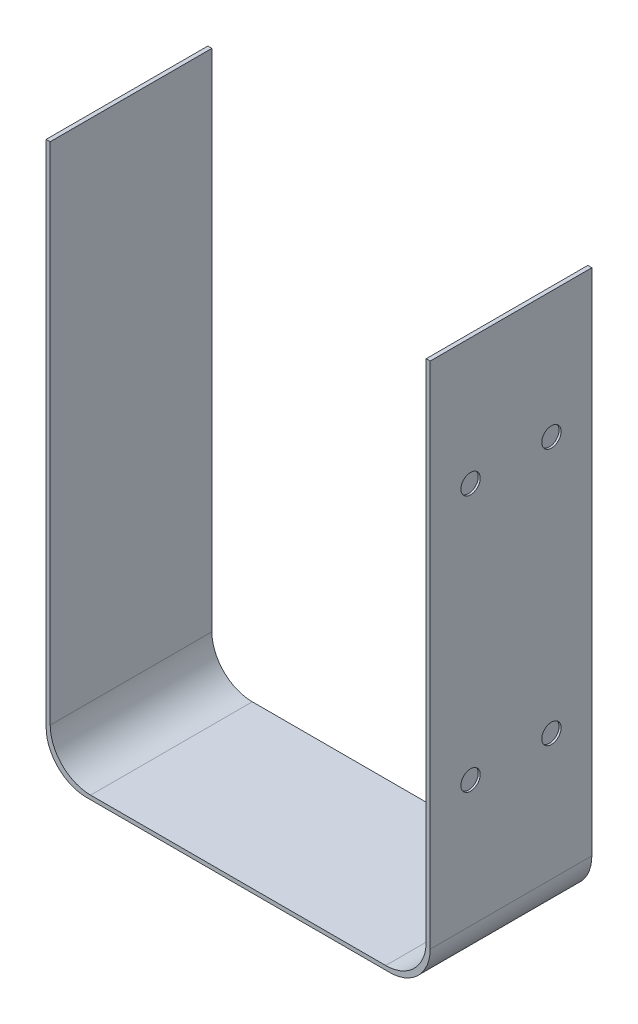
ISO-10303-21;
HEADER;
FILE_DESCRIPTION(('STEP AP214'),'2;1');
FILE_NAME('part.step','',(''),(''),'','','');
FILE_SCHEMA(('AUTOMOTIVE_DESIGN { 1 0 10303 214 1 1 1 1 }'));
ENDSEC;
DATA;
#1=APPLICATION_CONTEXT('core data for automotive mechanical design processes');
#2=APPLICATION_PROTOCOL_DEFINITION('international standard','automotive_design',2000,#1);
#3=PRODUCT_CONTEXT('',#1,'mechanical');
#4=PRODUCT('Part','Part','',(#3));
#5=PRODUCT_RELATED_PRODUCT_CATEGORY('part','',(#4));
#6=PRODUCT_DEFINITION_FORMATION('','',#4);
#7=PRODUCT_DEFINITION_CONTEXT('part definition',#1,'design');
#8=PRODUCT_DEFINITION('design','',#6,#7);
#9=PRODUCT_DEFINITION_SHAPE('','',#8);
#10=(LENGTH_UNIT() NAMED_UNIT(*) SI_UNIT(.MILLI.,.METRE.));
#11=(NAMED_UNIT(*) PLANE_ANGLE_UNIT() SI_UNIT($,.RADIAN.));
#12=(NAMED_UNIT(*) SI_UNIT($,.STERADIAN.) SOLID_ANGLE_UNIT());
#13=UNCERTAINTY_MEASURE_WITH_UNIT(LENGTH_MEASURE(1.E-05),#10,'distance_accuracy_value','');
#14=(GEOMETRIC_REPRESENTATION_CONTEXT(3) GLOBAL_UNCERTAINTY_ASSIGNED_CONTEXT((#13)) GLOBAL_UNIT_ASSIGNED_CONTEXT((#10,
#11,#12)) REPRESENTATION_CONTEXT('',''));
#15=CARTESIAN_POINT('',(0.,0.,0.));
#16=DIRECTION('',(0.,0.,1.));
#17=DIRECTION('',(1.,0.,0.));
#18=AXIS2_PLACEMENT_3D('',#15,#16,#17);
#19=CARTESIAN_POINT('',(-54.6515602948094,-3.22142857142857,8.));
#20=DIRECTION('',(0.,0.,-1.));
#21=DIRECTION('',(-1.,0.,0.));
#22=AXIS2_PLACEMENT_3D('',#19,#20,#21);
#23=CYLINDRICAL_SURFACE('',#22,2.);
#24=CARTESIAN_POINT('',(-54.6515602948094,-3.22142857142857,0.));
#25=DIRECTION('',(0.,0.,-1.));
#26=DIRECTION('',(1.,0.,0.));
#27=AXIS2_PLACEMENT_3D('',#24,#25,#26);
#28=CIRCLE('',#27,2.);
#29=CARTESIAN_POINT('',(-54.6515602948094,-5.22142857142857,0.));
#30=VERTEX_POINT('',#29);
#31=CARTESIAN_POINT('',(-56.6515602948094,-3.22142857142855,0.));
#32=VERTEX_POINT('',#31);
#33=EDGE_CURVE('E153',#30,#32,#28,.T.);
#34=ORIENTED_EDGE('',*,*,#33,.T.);
#35=DIRECTION('',(0.,0.,-1.));
#36=VECTOR('',#35,1.);
#37=CARTESIAN_POINT('',(-56.6515602948094,-3.22142857142855,8.));
#38=LINE('',#37,#36);
#39=CARTESIAN_POINT('',(-56.6515602948094,-3.22142857142855,8.));
#40=VERTEX_POINT('',#39);
#41=EDGE_CURVE('E11',#40,#32,#38,.T.);
#42=ORIENTED_EDGE('',*,*,#41,.F.);
#43=CARTESIAN_POINT('',(-54.6515602948094,-3.22142857142857,8.));
#44=DIRECTION('',(0.,0.,-1.));
#45=DIRECTION('',(1.,0.,0.));
#46=AXIS2_PLACEMENT_3D('',#43,#44,#45);
#47=CIRCLE('',#46,2.);
#48=CARTESIAN_POINT('',(-54.6515602948094,-5.22142857142857,8.));
#49=VERTEX_POINT('',#48);
#50=EDGE_CURVE('E176',#49,#40,#47,.T.);
#51=ORIENTED_EDGE('',*,*,#50,.F.);
#52=DIRECTION('',(0.,0.,-1.));
#53=VECTOR('',#52,1.);
#54=CARTESIAN_POINT('',(-54.6515602948094,-5.22142857142857,8.));
#55=LINE('',#54,#53);
#56=EDGE_CURVE('E149',#49,#30,#55,.T.);
#57=ORIENTED_EDGE('',*,*,#56,.T.);
#58=EDGE_LOOP('',(#34,#42,#51,#57));
#59=FACE_BOUND('',#58,.T.);
#60=ADVANCED_FACE('F33',(#59),#23,.F.);
#61=CARTESIAN_POINT('',(-56.6515602948094,21.7785714285714,8.));
#62=DIRECTION('',(-1.,0.,0.));
#63=DIRECTION('',(0.,0.,1.));
#64=AXIS2_PLACEMENT_3D('',#61,#62,#63);
#65=PLANE('',#64);
#66=DIRECTION('',(0.,1.,0.));
#67=VECTOR('',#66,1.);
#68=CARTESIAN_POINT('',(-56.6515602948094,21.7785714285714,0.));
#69=LINE('',#68,#67);
#70=CARTESIAN_POINT('',(-56.6515602948094,21.7785714285714,0.));
#71=VERTEX_POINT('',#70);
#72=EDGE_CURVE('E156',#32,#71,#69,.T.);
#73=ORIENTED_EDGE('',*,*,#72,.T.);
#74=DIRECTION('',(0.,0.,-1.));
#75=VECTOR('',#74,1.);
#76=CARTESIAN_POINT('',(-56.6515602948094,21.7785714285714,8.));
#77=LINE('',#76,#75);
#78=CARTESIAN_POINT('',(-56.6515602948094,21.7785714285714,8.));
#79=VERTEX_POINT('',#78);
#80=EDGE_CURVE('E41',#79,#71,#77,.T.);
#81=ORIENTED_EDGE('',*,*,#80,.F.);
#82=DIRECTION('',(0.,1.,0.));
#83=VECTOR('',#82,1.);
#84=CARTESIAN_POINT('',(-56.6515602948094,21.7785714285714,8.));
#85=LINE('',#84,#83);
#86=EDGE_CURVE('E104',#40,#79,#85,.T.);
#87=ORIENTED_EDGE('',*,*,#86,.F.);
#88=ORIENTED_EDGE('',*,*,#41,.T.);
#89=EDGE_LOOP('',(#73,#81,#87,#88));
#90=FACE_BOUND('',#89,.T.);
#91=ADVANCED_FACE('F254',(#90),#65,.F.);
#92=CARTESIAN_POINT('',(-56.6515602948094,21.7785714285714,8.));
#93=DIRECTION('',(0.,-1.,0.));
#94=DIRECTION('',(0.,0.,-1.));
#95=AXIS2_PLACEMENT_3D('',#92,#93,#94);
#96=PLANE('',#95);
#97=DIRECTION('',(-1.,0.,0.));
#98=VECTOR('',#97,1.);
#99=CARTESIAN_POINT('',(-56.6515602948094,21.7785714285714,0.));
#100=LINE('',#99,#98);
#101=CARTESIAN_POINT('',(-56.8515602948094,21.7785714285714,0.));
#102=VERTEX_POINT('',#101);
#103=EDGE_CURVE('E159',#71,#102,#100,.T.);
#104=ORIENTED_EDGE('',*,*,#103,.T.);
#105=DIRECTION('',(0.,0.,-1.));
#106=VECTOR('',#105,1.);
#107=CARTESIAN_POINT('',(-56.8515602948094,21.7785714285714,8.));
#108=LINE('',#107,#106);
#109=CARTESIAN_POINT('',(-56.8515602948094,21.7785714285714,8.));
#110=VERTEX_POINT('',#109);
#111=EDGE_CURVE('E195',#110,#102,#108,.T.);
#112=ORIENTED_EDGE('',*,*,#111,.F.);
#113=DIRECTION('',(-1.,0.,0.));
#114=VECTOR('',#113,1.);
#115=CARTESIAN_POINT('',(-56.6515602948094,21.7785714285714,8.));
#116=LINE('',#115,#114);
#117=EDGE_CURVE('E203',#79,#110,#116,.T.);
#118=ORIENTED_EDGE('',*,*,#117,.F.);
#119=ORIENTED_EDGE('',*,*,#80,.T.);
#120=EDGE_LOOP('',(#104,#112,#118,#119));
#121=FACE_BOUND('',#120,.T.);
#122=ADVANCED_FACE('F201',(#121),#96,.F.);
#123=CARTESIAN_POINT('',(-56.8515602948094,21.7785714285714,8.));
#124=DIRECTION('',(1.,0.,0.));
#125=DIRECTION('',(0.,0.,-1.));
#126=AXIS2_PLACEMENT_3D('',#123,#124,#125);
#127=PLANE('',#126);
#128=CARTESIAN_POINT('',(-56.8515602948094,15.5285714285714,2.));
#129=DIRECTION('',(-1.,0.,0.));
#130=DIRECTION('',(0.,0.,-1.));
#131=AXIS2_PLACEMENT_3D('',#128,#129,#130);
#132=CIRCLE('',#131,0.499999999999999);
#133=CARTESIAN_POINT('',(-56.8515602948094,15.5285714285714,1.5));
#134=VERTEX_POINT('',#133);
#135=EDGE_CURVE('E491',#134,#134,#132,.T.);
#136=ORIENTED_EDGE('',*,*,#135,.F.);
#137=EDGE_LOOP('',(#136));
#138=FACE_BOUND('',#137,.T.);
#139=CARTESIAN_POINT('',(-56.8515602948094,15.5285714285714,6.));
#140=DIRECTION('',(-1.,0.,0.));
#141=DIRECTION('',(0.,0.,1.));
#142=AXIS2_PLACEMENT_3D('',#139,#140,#141);
#143=CIRCLE('',#142,0.499999999999999);
#144=CARTESIAN_POINT('',(-56.8515602948094,15.5285714285714,6.5));
#145=VERTEX_POINT('',#144);
#146=EDGE_CURVE('E490',#145,#145,#143,.T.);
#147=ORIENTED_EDGE('',*,*,#146,.F.);
#148=EDGE_LOOP('',(#147));
#149=FACE_BOUND('',#148,.T.);
#150=CARTESIAN_POINT('',(-56.8515602948094,2.82857142857145,6.));
#151=DIRECTION('',(-1.,0.,0.));
#152=DIRECTION('',(0.,0.,-1.));
#153=AXIS2_PLACEMENT_3D('',#150,#151,#152);
#154=CIRCLE('',#153,0.499999999999999);
#155=CARTESIAN_POINT('',(-56.8515602948094,2.82857142857145,5.5));
#156=VERTEX_POINT('',#155);
#157=EDGE_CURVE('E549',#156,#156,#154,.T.);
#158=ORIENTED_EDGE('',*,*,#157,.F.);
#159=EDGE_LOOP('',(#158));
#160=FACE_BOUND('',#159,.T.);
#161=CARTESIAN_POINT('',(-56.8515602948094,2.82857142857144,2.));
#162=DIRECTION('',(-1.,0.,0.));
#163=DIRECTION('',(0.,0.,1.));
#164=AXIS2_PLACEMENT_3D('',#161,#162,#163);
#165=CIRCLE('',#164,0.499999999999999);
#166=CARTESIAN_POINT('',(-56.8515602948094,2.82857142857144,2.5));
#167=VERTEX_POINT('',#166);
#168=EDGE_CURVE('E504',#167,#167,#165,.T.);
#169=ORIENTED_EDGE('',*,*,#168,.F.);
#170=EDGE_LOOP('',(#169));
#171=FACE_BOUND('',#170,.T.);
#172=DIRECTION('',(0.,-1.,0.));
#173=VECTOR('',#172,1.);
#174=CARTESIAN_POINT('',(-56.8515602948094,21.7785714285714,0.));
#175=LINE('',#174,#173);
#176=CARTESIAN_POINT('',(-56.8515602948094,-3.42142857142855,0.));
#177=VERTEX_POINT('',#176);
#178=EDGE_CURVE('E161',#102,#177,#175,.T.);
#179=ORIENTED_EDGE('',*,*,#178,.T.);
#180=DIRECTION('',(0.,0.,-1.));
#181=VECTOR('',#180,1.);
#182=CARTESIAN_POINT('',(-56.8515602948094,-3.42142857142855,8.));
#183=LINE('',#182,#181);
#184=CARTESIAN_POINT('',(-56.8515602948094,-3.42142857142855,8.));
#185=VERTEX_POINT('',#184);
#186=EDGE_CURVE('E192',#185,#177,#183,.T.);
#187=ORIENTED_EDGE('',*,*,#186,.F.);
#188=DIRECTION('',(0.,-1.,0.));
#189=VECTOR('',#188,1.);
#190=CARTESIAN_POINT('',(-56.8515602948094,21.7785714285714,8.));
#191=LINE('',#190,#189);
#192=EDGE_CURVE('E221',#110,#185,#191,.T.);
#193=ORIENTED_EDGE('',*,*,#192,.F.);
#194=ORIENTED_EDGE('',*,*,#111,.T.);
#195=EDGE_LOOP('',(#179,#187,#193,#194));
#196=FACE_BOUND('',#195,.T.);
#197=ADVANCED_FACE('F212',(#138,#149,#160,#171,#196),#127,.F.);
#198=CARTESIAN_POINT('',(-54.8515602948094,-3.42142857142857,8.));
#199=DIRECTION('',(0.,0.,-1.));
#200=DIRECTION('',(-1.,0.,0.));
#201=AXIS2_PLACEMENT_3D('',#198,#199,#200);
#202=CYLINDRICAL_SURFACE('',#201,2.);
#203=CARTESIAN_POINT('',(-54.8515602948094,-3.42142857142857,0.));
#204=DIRECTION('',(0.,0.,1.));
#205=DIRECTION('',(1.,0.,0.));
#206=AXIS2_PLACEMENT_3D('',#203,#204,#205);
#207=CIRCLE('',#206,2.);
#208=CARTESIAN_POINT('',(-54.8515602948094,-5.42142857142857,0.));
#209=VERTEX_POINT('',#208);
#210=EDGE_CURVE('E163',#177,#209,#207,.T.);
#211=ORIENTED_EDGE('',*,*,#210,.T.);
#212=DIRECTION('',(0.,0.,-1.));
#213=VECTOR('',#212,1.);
#214=CARTESIAN_POINT('',(-54.8515602948094,-5.42142857142857,8.));
#215=LINE('',#214,#213);
#216=CARTESIAN_POINT('',(-54.8515602948094,-5.42142857142857,8.));
#217=VERTEX_POINT('',#216);
#218=EDGE_CURVE('E189',#217,#209,#215,.T.);
#219=ORIENTED_EDGE('',*,*,#218,.F.);
#220=CARTESIAN_POINT('',(-54.8515602948094,-3.42142857142857,8.));
#221=DIRECTION('',(0.,0.,1.));
#222=DIRECTION('',(1.,0.,0.));
#223=AXIS2_PLACEMENT_3D('',#220,#221,#222);
#224=CIRCLE('',#223,2.);
#225=EDGE_CURVE('E218',#185,#217,#224,.T.);
#226=ORIENTED_EDGE('',*,*,#225,.F.);
#227=ORIENTED_EDGE('',*,*,#186,.T.);
#228=EDGE_LOOP('',(#211,#219,#226,#227));
#229=FACE_BOUND('',#228,.T.);
#230=ADVANCED_FACE('F216',(#229),#202,.T.);
#231=CARTESIAN_POINT('',(-54.8515602948094,-5.42142857142857,8.));
#232=DIRECTION('',(0.,1.,0.));
#233=DIRECTION('',(-1.,0.,0.));
#234=AXIS2_PLACEMENT_3D('',#231,#232,#233);
#235=PLANE('',#234);
#236=DIRECTION('',(1.,0.,0.));
#237=VECTOR('',#236,1.);
#238=CARTESIAN_POINT('',(-54.8515602948094,-5.42142857142857,0.));
#239=LINE('',#238,#237);
#240=CARTESIAN_POINT('',(-39.8515602948095,-5.42142857142857,0.));
#241=VERTEX_POINT('',#240);
#242=EDGE_CURVE('E165',#209,#241,#239,.T.);
#243=ORIENTED_EDGE('',*,*,#242,.T.);
#244=DIRECTION('',(0.,0.,-1.));
#245=VECTOR('',#244,1.);
#246=CARTESIAN_POINT('',(-39.8515602948095,-5.42142857142857,8.));
#247=LINE('',#246,#245);
#248=CARTESIAN_POINT('',(-39.8515602948095,-5.42142857142857,8.));
#249=VERTEX_POINT('',#248);
#250=EDGE_CURVE('E186',#249,#241,#247,.T.);
#251=ORIENTED_EDGE('',*,*,#250,.F.);
#252=DIRECTION('',(1.,0.,0.));
#253=VECTOR('',#252,1.);
#254=CARTESIAN_POINT('',(-54.8515602948094,-5.42142857142857,8.));
#255=LINE('',#254,#253);
#256=EDGE_CURVE('E220',#217,#249,#255,.T.);
#257=ORIENTED_EDGE('',*,*,#256,.F.);
#258=ORIENTED_EDGE('',*,*,#218,.T.);
#259=EDGE_LOOP('',(#243,#251,#257,#258));
#260=FACE_BOUND('',#259,.T.);
#261=ADVANCED_FACE('F268',(#260),#235,.F.);
#262=CARTESIAN_POINT('',(-39.8515602948094,-3.42142857142857,8.));
#263=DIRECTION('',(0.,0.,-1.));
#264=DIRECTION('',(-1.,0.,0.));
#265=AXIS2_PLACEMENT_3D('',#262,#263,#264);
#266=CYLINDRICAL_SURFACE('',#265,2.);
#267=CARTESIAN_POINT('',(-39.8515602948094,-3.42142857142857,0.));
#268=DIRECTION('',(0.,0.,1.));
#269=DIRECTION('',(-1.,0.,0.));
#270=AXIS2_PLACEMENT_3D('',#267,#268,#269);
#271=CIRCLE('',#270,2.);
#272=CARTESIAN_POINT('',(-37.8515602948094,-3.42142857142856,0.));
#273=VERTEX_POINT('',#272);
#274=EDGE_CURVE('E167',#241,#273,#271,.T.);
#275=ORIENTED_EDGE('',*,*,#274,.T.);
#276=DIRECTION('',(0.,0.,-1.));
#277=VECTOR('',#276,1.);
#278=CARTESIAN_POINT('',(-37.8515602948094,-3.42142857142856,8.));
#279=LINE('',#278,#277);
#280=CARTESIAN_POINT('',(-37.8515602948094,-3.42142857142856,8.));
#281=VERTEX_POINT('',#280);
#282=EDGE_CURVE('E183',#281,#273,#279,.T.);
#283=ORIENTED_EDGE('',*,*,#282,.F.);
#284=CARTESIAN_POINT('',(-39.8515602948094,-3.42142857142857,8.));
#285=DIRECTION('',(0.,0.,1.));
#286=DIRECTION('',(-1.,0.,0.));
#287=AXIS2_PLACEMENT_3D('',#284,#285,#286);
#288=CIRCLE('',#287,2.);
#289=EDGE_CURVE('E223',#249,#281,#288,.T.);
#290=ORIENTED_EDGE('',*,*,#289,.F.);
#291=ORIENTED_EDGE('',*,*,#250,.T.);
#292=EDGE_LOOP('',(#275,#283,#290,#291));
#293=FACE_BOUND('',#292,.T.);
#294=ADVANCED_FACE('F271',(#293),#266,.T.);
#295=CARTESIAN_POINT('',(-37.8515602948094,21.7785714285714,8.));
#296=DIRECTION('',(-1.,0.,0.));
#297=DIRECTION('',(0.,0.,1.));
#298=AXIS2_PLACEMENT_3D('',#295,#296,#297);
#299=PLANE('',#298);
#300=CARTESIAN_POINT('',(-37.8515602948094,2.82857142857144,6.));
#301=DIRECTION('',(1.,0.,0.));
#302=DIRECTION('',(0.,0.,1.));
#303=AXIS2_PLACEMENT_3D('',#300,#301,#302);
#304=CIRCLE('',#303,0.478785513283905);
#305=CARTESIAN_POINT('',(-37.8515602948094,2.82857142857144,6.4787855132839));
#306=VERTEX_POINT('',#305);
#307=EDGE_CURVE('E503',#306,#306,#304,.T.);
#308=ORIENTED_EDGE('',*,*,#307,.F.);
#309=EDGE_LOOP('',(#308));
#310=FACE_BOUND('',#309,.T.);
#311=CARTESIAN_POINT('',(-37.8515602948094,2.82857142857144,2.));
#312=DIRECTION('',(1.,0.,0.));
#313=DIRECTION('',(0.,0.,-1.));
#314=AXIS2_PLACEMENT_3D('',#311,#312,#313);
#315=CIRCLE('',#314,0.478785513283905);
#316=CARTESIAN_POINT('',(-37.8515602948094,2.82857142857144,1.5212144867161));
#317=VERTEX_POINT('',#316);
#318=EDGE_CURVE('E518',#317,#317,#315,.T.);
#319=ORIENTED_EDGE('',*,*,#318,.F.);
#320=EDGE_LOOP('',(#319));
#321=FACE_BOUND('',#320,.T.);
#322=CARTESIAN_POINT('',(-37.8515602948094,15.5285714285714,2.));
#323=DIRECTION('',(1.,0.,0.));
#324=DIRECTION('',(0.,0.,1.));
#325=AXIS2_PLACEMENT_3D('',#322,#323,#324);
#326=CIRCLE('',#325,0.478785513283905);
#327=CARTESIAN_POINT('',(-37.8515602948094,15.5285714285714,2.47878551328391));
#328=VERTEX_POINT('',#327);
#329=EDGE_CURVE('E512',#328,#328,#326,.T.);
#330=ORIENTED_EDGE('',*,*,#329,.F.);
#331=EDGE_LOOP('',(#330));
#332=FACE_BOUND('',#331,.T.);
#333=CARTESIAN_POINT('',(-37.8515602948094,15.5285714285714,6.));
#334=DIRECTION('',(1.,0.,0.));
#335=DIRECTION('',(0.,0.,-1.));
#336=AXIS2_PLACEMENT_3D('',#333,#334,#335);
#337=CIRCLE('',#336,0.478785513283905);
#338=CARTESIAN_POINT('',(-37.8515602948094,15.5285714285714,5.5212144867161));
#339=VERTEX_POINT('',#338);
#340=EDGE_CURVE('E511',#339,#339,#337,.T.);
#341=ORIENTED_EDGE('',*,*,#340,.F.);
#342=EDGE_LOOP('',(#341));
#343=FACE_BOUND('',#342,.T.);
#344=DIRECTION('',(0.,1.,0.));
#345=VECTOR('',#344,1.);
#346=CARTESIAN_POINT('',(-37.8515602948094,21.7785714285714,0.));
#347=LINE('',#346,#345);
#348=CARTESIAN_POINT('',(-37.8515602948094,21.7785714285714,0.));
#349=VERTEX_POINT('',#348);
#350=EDGE_CURVE('E169',#273,#349,#347,.T.);
#351=ORIENTED_EDGE('',*,*,#350,.T.);
#352=DIRECTION('',(0.,0.,-1.));
#353=VECTOR('',#352,1.);
#354=CARTESIAN_POINT('',(-37.8515602948094,21.7785714285714,8.));
#355=LINE('',#354,#353);
#356=CARTESIAN_POINT('',(-37.8515602948094,21.7785714285714,8.));
#357=VERTEX_POINT('',#356);
#358=EDGE_CURVE('E180',#357,#349,#355,.T.);
#359=ORIENTED_EDGE('',*,*,#358,.F.);
#360=DIRECTION('',(0.,1.,0.));
#361=VECTOR('',#360,1.);
#362=CARTESIAN_POINT('',(-37.8515602948094,21.7785714285714,8.));
#363=LINE('',#362,#361);
#364=EDGE_CURVE('E229',#281,#357,#363,.T.);
#365=ORIENTED_EDGE('',*,*,#364,.F.);
#366=ORIENTED_EDGE('',*,*,#282,.T.);
#367=EDGE_LOOP('',(#351,#359,#365,#366));
#368=FACE_BOUND('',#367,.T.);
#369=ADVANCED_FACE('F235',(#310,#321,#332,#343,#368),#299,.F.);
#370=CARTESIAN_POINT('',(-37.8515602948094,21.7785714285714,8.));
#371=DIRECTION('',(0.,-1.,0.));
#372=DIRECTION('',(0.,0.,-1.));
#373=AXIS2_PLACEMENT_3D('',#370,#371,#372);
#374=PLANE('',#373);
#375=DIRECTION('',(-1.,0.,0.));
#376=VECTOR('',#375,1.);
#377=CARTESIAN_POINT('',(-37.8515602948094,21.7785714285714,0.));
#378=LINE('',#377,#376);
#379=CARTESIAN_POINT('',(-38.0515602948094,21.7785714285714,0.));
#380=VERTEX_POINT('',#379);
#381=EDGE_CURVE('E171',#349,#380,#378,.T.);
#382=ORIENTED_EDGE('',*,*,#381,.T.);
#383=DIRECTION('',(0.,0.,-1.));
#384=VECTOR('',#383,1.);
#385=CARTESIAN_POINT('',(-38.0515602948094,21.7785714285714,8.));
#386=LINE('',#385,#384);
#387=CARTESIAN_POINT('',(-38.0515602948094,21.7785714285714,8.));
#388=VERTEX_POINT('',#387);
#389=EDGE_CURVE('E144',#388,#380,#386,.T.);
#390=ORIENTED_EDGE('',*,*,#389,.F.);
#391=DIRECTION('',(-1.,0.,0.));
#392=VECTOR('',#391,1.);
#393=CARTESIAN_POINT('',(-37.8515602948094,21.7785714285714,8.));
#394=LINE('',#393,#392);
#395=EDGE_CURVE('E135',#357,#388,#394,.T.);
#396=ORIENTED_EDGE('',*,*,#395,.F.);
#397=ORIENTED_EDGE('',*,*,#358,.T.);
#398=EDGE_LOOP('',(#382,#390,#396,#397));
#399=FACE_BOUND('',#398,.T.);
#400=ADVANCED_FACE('F239',(#399),#374,.F.);
#401=CARTESIAN_POINT('',(-38.0515602948094,21.7785714285714,8.));
#402=DIRECTION('',(1.,0.,0.));
#403=DIRECTION('',(0.,0.,-1.));
#404=AXIS2_PLACEMENT_3D('',#401,#402,#403);
#405=PLANE('',#404);
#406=DIRECTION('',(0.,-1.,0.));
#407=VECTOR('',#406,1.);
#408=CARTESIAN_POINT('',(-38.0515602948094,21.7785714285714,0.));
#409=LINE('',#408,#407);
#410=CARTESIAN_POINT('',(-38.0515602948094,-3.22142857142855,0.));
#411=VERTEX_POINT('',#410);
#412=EDGE_CURVE('E143',#380,#411,#409,.T.);
#413=ORIENTED_EDGE('',*,*,#412,.T.);
#414=DIRECTION('',(0.,0.,-1.));
#415=VECTOR('',#414,1.);
#416=CARTESIAN_POINT('',(-38.0515602948094,-3.22142857142855,8.));
#417=LINE('',#416,#415);
#418=CARTESIAN_POINT('',(-38.0515602948094,-3.22142857142855,8.));
#419=VERTEX_POINT('',#418);
#420=EDGE_CURVE('E140',#419,#411,#417,.T.);
#421=ORIENTED_EDGE('',*,*,#420,.F.);
#422=DIRECTION('',(0.,-1.,0.));
#423=VECTOR('',#422,1.);
#424=CARTESIAN_POINT('',(-38.0515602948094,21.7785714285714,8.));
#425=LINE('',#424,#423);
#426=EDGE_CURVE('E129',#388,#419,#425,.T.);
#427=ORIENTED_EDGE('',*,*,#426,.F.);
#428=ORIENTED_EDGE('',*,*,#389,.T.);
#429=EDGE_LOOP('',(#413,#421,#427,#428));
#430=FACE_BOUND('',#429,.T.);
#431=ADVANCED_FACE('F141',(#430),#405,.F.);
#432=CARTESIAN_POINT('',(-40.0515602948094,-3.22142857142857,8.));
#433=DIRECTION('',(0.,0.,-1.));
#434=DIRECTION('',(-1.,0.,0.));
#435=AXIS2_PLACEMENT_3D('',#432,#433,#434);
#436=CYLINDRICAL_SURFACE('',#435,2.);
#437=CARTESIAN_POINT('',(-40.0515602948094,-3.22142857142857,0.));
#438=DIRECTION('',(0.,0.,-1.));
#439=DIRECTION('',(-1.,0.,0.));
#440=AXIS2_PLACEMENT_3D('',#437,#438,#439);
#441=CIRCLE('',#440,2.);
#442=CARTESIAN_POINT('',(-40.0515602948095,-5.22142857142857,0.));
#443=VERTEX_POINT('',#442);
#444=EDGE_CURVE('E90',#411,#443,#441,.T.);
#445=ORIENTED_EDGE('',*,*,#444,.T.);
#446=DIRECTION('',(0.,0.,-1.));
#447=VECTOR('',#446,1.);
#448=CARTESIAN_POINT('',(-40.0515602948095,-5.22142857142857,8.));
#449=LINE('',#448,#447);
#450=CARTESIAN_POINT('',(-40.0515602948095,-5.22142857142857,8.));
#451=VERTEX_POINT('',#450);
#452=EDGE_CURVE('E145',#451,#443,#449,.T.);
#453=ORIENTED_EDGE('',*,*,#452,.F.);
#454=CARTESIAN_POINT('',(-40.0515602948094,-3.22142857142857,8.));
#455=DIRECTION('',(0.,0.,-1.));
#456=DIRECTION('',(-1.,0.,0.));
#457=AXIS2_PLACEMENT_3D('',#454,#455,#456);
#458=CIRCLE('',#457,2.);
#459=EDGE_CURVE('E133',#419,#451,#458,.T.);
#460=ORIENTED_EDGE('',*,*,#459,.F.);
#461=ORIENTED_EDGE('',*,*,#420,.T.);
#462=EDGE_LOOP('',(#445,#453,#460,#461));
#463=FACE_BOUND('',#462,.T.);
#464=ADVANCED_FACE('F147',(#463),#436,.F.);
#465=CARTESIAN_POINT('',(-54.6515602948094,-5.22142857142857,8.));
#466=DIRECTION('',(0.,-1.,0.));
#467=DIRECTION('',(0.,0.,-1.));
#468=AXIS2_PLACEMENT_3D('',#465,#466,#467);
#469=PLANE('',#468);
#470=DIRECTION('',(-1.,0.,0.));
#471=VECTOR('',#470,1.);
#472=CARTESIAN_POINT('',(-54.6515602948094,-5.22142857142857,0.));
#473=LINE('',#472,#471);
#474=EDGE_CURVE('E96',#443,#30,#473,.T.);
#475=ORIENTED_EDGE('',*,*,#474,.T.);
#476=ORIENTED_EDGE('',*,*,#56,.F.);
#477=DIRECTION('',(-1.,0.,0.));
#478=VECTOR('',#477,1.);
#479=CARTESIAN_POINT('',(-54.6515602948094,-5.22142857142857,8.));
#480=LINE('',#479,#478);
#481=EDGE_CURVE('E49',#451,#49,#480,.T.);
#482=ORIENTED_EDGE('',*,*,#481,.F.);
#483=ORIENTED_EDGE('',*,*,#452,.T.);
#484=EDGE_LOOP('',(#475,#476,#482,#483));
#485=FACE_BOUND('',#484,.T.);
#486=ADVANCED_FACE('F243',(#485),#469,.F.);
#487=CARTESIAN_POINT('',(-54.6515602948094,-3.22142857142857,8.));
#488=DIRECTION('',(0.,0.,1.));
#489=DIRECTION('',(1.,0.,0.));
#490=AXIS2_PLACEMENT_3D('',#487,#488,#489);
#491=PLANE('',#490);
#492=ORIENTED_EDGE('',*,*,#50,.T.);
#493=ORIENTED_EDGE('',*,*,#86,.T.);
#494=ORIENTED_EDGE('',*,*,#117,.T.);
#495=ORIENTED_EDGE('',*,*,#192,.T.);
#496=ORIENTED_EDGE('',*,*,#225,.T.);
#497=ORIENTED_EDGE('',*,*,#256,.T.);
#498=ORIENTED_EDGE('',*,*,#289,.T.);
#499=ORIENTED_EDGE('',*,*,#364,.T.);
#500=ORIENTED_EDGE('',*,*,#395,.T.);
#501=ORIENTED_EDGE('',*,*,#426,.T.);
#502=ORIENTED_EDGE('',*,*,#459,.T.);
#503=ORIENTED_EDGE('',*,*,#481,.T.);
#504=EDGE_LOOP('',(#492,#493,#494,#495,#496,#497,#498,#499,#500,#501,#502,#503));
#505=FACE_BOUND('',#504,.T.);
#506=ADVANCED_FACE('F131',(#505),#491,.T.);
#507=CARTESIAN_POINT('',(-54.6515602948094,-3.22142857142857,0.));
#508=DIRECTION('',(0.,0.,1.));
#509=DIRECTION('',(1.,0.,0.));
#510=AXIS2_PLACEMENT_3D('',#507,#508,#509);
#511=PLANE('',#510);
#512=ORIENTED_EDGE('',*,*,#33,.F.);
#513=ORIENTED_EDGE('',*,*,#474,.F.);
#514=ORIENTED_EDGE('',*,*,#444,.F.);
#515=ORIENTED_EDGE('',*,*,#412,.F.);
#516=ORIENTED_EDGE('',*,*,#381,.F.);
#517=ORIENTED_EDGE('',*,*,#350,.F.);
#518=ORIENTED_EDGE('',*,*,#274,.F.);
#519=ORIENTED_EDGE('',*,*,#242,.F.);
#520=ORIENTED_EDGE('',*,*,#210,.F.);
#521=ORIENTED_EDGE('',*,*,#178,.F.);
#522=ORIENTED_EDGE('',*,*,#103,.F.);
#523=ORIENTED_EDGE('',*,*,#72,.F.);
#524=EDGE_LOOP('',(#512,#513,#514,#515,#516,#517,#518,#519,#520,#521,#522,#523));
#525=FACE_BOUND('',#524,.T.);
#526=ADVANCED_FACE('F207',(#525),#511,.F.);
#527=CARTESIAN_POINT('',(-37.9515602948094,15.5285714285714,6.));
#528=DIRECTION('',(1.,0.,0.));
#529=DIRECTION('',(0.,0.,-1.));
#530=AXIS2_PLACEMENT_3D('',#527,#528,#529);
#531=CYLINDRICAL_SURFACE('',#530,0.478785513283905);
#532=CARTESIAN_POINT('',(-37.9515602948094,15.5285714285714,6.));
#533=DIRECTION('',(1.,0.,0.));
#534=DIRECTION('',(0.,0.,-1.));
#535=AXIS2_PLACEMENT_3D('',#532,#533,#534);
#536=CIRCLE('',#535,0.478785513283905);
#537=CARTESIAN_POINT('',(-37.9515602948094,15.5285714285714,5.5212144867161));
#538=VERTEX_POINT('',#537);
#539=EDGE_CURVE('E157',#538,#538,#536,.T.);
#540=ORIENTED_EDGE('',*,*,#539,.F.);
#541=EDGE_LOOP('',(#540));
#542=FACE_BOUND('',#541,.T.);
#543=ORIENTED_EDGE('',*,*,#340,.T.);
#544=EDGE_LOOP('',(#543));
#545=FACE_BOUND('',#544,.T.);
#546=ADVANCED_FACE('F309',(#542,#545),#531,.F.);
#547=CARTESIAN_POINT('',(-37.9515602948094,15.5285714285714,6.));
#548=DIRECTION('',(1.,0.,0.));
#549=DIRECTION('',(0.,0.,-1.));
#550=AXIS2_PLACEMENT_3D('',#547,#548,#549);
#551=PLANE('',#550);
#552=ORIENTED_EDGE('',*,*,#539,.T.);
#553=EDGE_LOOP('',(#552));
#554=FACE_BOUND('',#553,.T.);
#555=ADVANCED_FACE('F325',(#554),#551,.T.);
#556=CARTESIAN_POINT('',(-37.9515602948094,15.5285714285714,2.));
#557=DIRECTION('',(1.,0.,0.));
#558=DIRECTION('',(0.,0.,-1.));
#559=AXIS2_PLACEMENT_3D('',#556,#557,#558);
#560=CYLINDRICAL_SURFACE('',#559,0.478785513283905);
#561=CARTESIAN_POINT('',(-37.9515602948094,15.5285714285714,2.));
#562=DIRECTION('',(1.,0.,0.));
#563=DIRECTION('',(0.,0.,1.));
#564=AXIS2_PLACEMENT_3D('',#561,#562,#563);
#565=CIRCLE('',#564,0.478785513283905);
#566=CARTESIAN_POINT('',(-37.9515602948094,15.5285714285714,2.47878551328391));
#567=VERTEX_POINT('',#566);
#568=EDGE_CURVE('E508',#567,#567,#565,.T.);
#569=ORIENTED_EDGE('',*,*,#568,.F.);
#570=EDGE_LOOP('',(#569));
#571=FACE_BOUND('',#570,.T.);
#572=ORIENTED_EDGE('',*,*,#329,.T.);
#573=EDGE_LOOP('',(#572));
#574=FACE_BOUND('',#573,.T.);
#575=ADVANCED_FACE('F335',(#571,#574),#560,.F.);
#576=CARTESIAN_POINT('',(-37.9515602948094,15.5285714285714,2.));
#577=DIRECTION('',(-1.,0.,0.));
#578=DIRECTION('',(0.,0.,1.));
#579=AXIS2_PLACEMENT_3D('',#576,#577,#578);
#580=PLANE('',#579);
#581=ORIENTED_EDGE('',*,*,#568,.T.);
#582=EDGE_LOOP('',(#581));
#583=FACE_BOUND('',#582,.T.);
#584=ADVANCED_FACE('F345',(#583),#580,.F.);
#585=CARTESIAN_POINT('',(-37.9515602948094,2.82857142857144,2.));
#586=DIRECTION('',(1.,0.,0.));
#587=DIRECTION('',(0.,0.,-1.));
#588=AXIS2_PLACEMENT_3D('',#585,#586,#587);
#589=CYLINDRICAL_SURFACE('',#588,0.478785513283905);
#590=CARTESIAN_POINT('',(-37.9515602948094,2.82857142857144,2.));
#591=DIRECTION('',(1.,0.,0.));
#592=DIRECTION('',(0.,0.,-1.));
#593=AXIS2_PLACEMENT_3D('',#590,#591,#592);
#594=CIRCLE('',#593,0.478785513283905);
#595=CARTESIAN_POINT('',(-37.9515602948094,2.82857142857144,1.5212144867161));
#596=VERTEX_POINT('',#595);
#597=EDGE_CURVE('E515',#596,#596,#594,.T.);
#598=ORIENTED_EDGE('',*,*,#597,.F.);
#599=EDGE_LOOP('',(#598));
#600=FACE_BOUND('',#599,.T.);
#601=ORIENTED_EDGE('',*,*,#318,.T.);
#602=EDGE_LOOP('',(#601));
#603=FACE_BOUND('',#602,.T.);
#604=ADVANCED_FACE('F355',(#600,#603),#589,.F.);
#605=CARTESIAN_POINT('',(-37.9515602948094,2.82857142857144,2.));
#606=DIRECTION('',(1.,0.,0.));
#607=DIRECTION('',(0.,0.,-1.));
#608=AXIS2_PLACEMENT_3D('',#605,#606,#607);
#609=PLANE('',#608);
#610=ORIENTED_EDGE('',*,*,#597,.T.);
#611=EDGE_LOOP('',(#610));
#612=FACE_BOUND('',#611,.T.);
#613=ADVANCED_FACE('F365',(#612),#609,.T.);
#614=CARTESIAN_POINT('',(-37.9515602948094,2.82857142857144,6.));
#615=DIRECTION('',(1.,0.,0.));
#616=DIRECTION('',(0.,0.,-1.));
#617=AXIS2_PLACEMENT_3D('',#614,#615,#616);
#618=CYLINDRICAL_SURFACE('',#617,0.478785513283905);
#619=CARTESIAN_POINT('',(-37.9515602948094,2.82857142857144,6.));
#620=DIRECTION('',(1.,0.,0.));
#621=DIRECTION('',(0.,0.,1.));
#622=AXIS2_PLACEMENT_3D('',#619,#620,#621);
#623=CIRCLE('',#622,0.478785513283905);
#624=CARTESIAN_POINT('',(-37.9515602948094,2.82857142857144,6.4787855132839));
#625=VERTEX_POINT('',#624);
#626=EDGE_CURVE('E521',#625,#625,#623,.T.);
#627=ORIENTED_EDGE('',*,*,#626,.F.);
#628=EDGE_LOOP('',(#627));
#629=FACE_BOUND('',#628,.T.);
#630=ORIENTED_EDGE('',*,*,#307,.T.);
#631=EDGE_LOOP('',(#630));
#632=FACE_BOUND('',#631,.T.);
#633=ADVANCED_FACE('F375',(#629,#632),#618,.F.);
#634=CARTESIAN_POINT('',(-37.9515602948094,2.82857142857144,6.));
#635=DIRECTION('',(-1.,0.,0.));
#636=DIRECTION('',(0.,0.,1.));
#637=AXIS2_PLACEMENT_3D('',#634,#635,#636);
#638=PLANE('',#637);
#639=ORIENTED_EDGE('',*,*,#626,.T.);
#640=EDGE_LOOP('',(#639));
#641=FACE_BOUND('',#640,.T.);
#642=ADVANCED_FACE('F385',(#641),#638,.F.);
#643=CARTESIAN_POINT('',(-56.7515602948094,2.82857142857144,2.));
#644=DIRECTION('',(-1.,0.,0.));
#645=DIRECTION('',(0.,0.,1.));
#646=AXIS2_PLACEMENT_3D('',#643,#644,#645);
#647=CYLINDRICAL_SURFACE('',#646,0.499999999999999);
#648=CARTESIAN_POINT('',(-56.7515602948094,2.82857142857144,2.));
#649=DIRECTION('',(-1.,0.,0.));
#650=DIRECTION('',(0.,0.,1.));
#651=AXIS2_PLACEMENT_3D('',#648,#649,#650);
#652=CIRCLE('',#651,0.499999999999999);
#653=CARTESIAN_POINT('',(-56.7515602948094,2.82857142857144,2.5));
#654=VERTEX_POINT('',#653);
#655=EDGE_CURVE('E500',#654,#654,#652,.T.);
#656=ORIENTED_EDGE('',*,*,#655,.F.);
#657=EDGE_LOOP('',(#656));
#658=FACE_BOUND('',#657,.T.);
#659=ORIENTED_EDGE('',*,*,#168,.T.);
#660=EDGE_LOOP('',(#659));
#661=FACE_BOUND('',#660,.T.);
#662=ADVANCED_FACE('F395',(#658,#661),#647,.F.);
#663=CARTESIAN_POINT('',(-56.7515602948094,2.82857142857144,2.));
#664=DIRECTION('',(-1.,0.,0.));
#665=DIRECTION('',(0.,0.,1.));
#666=AXIS2_PLACEMENT_3D('',#663,#664,#665);
#667=PLANE('',#666);
#668=ORIENTED_EDGE('',*,*,#655,.T.);
#669=EDGE_LOOP('',(#668));
#670=FACE_BOUND('',#669,.T.);
#671=ADVANCED_FACE('F413',(#670),#667,.T.);
#672=CARTESIAN_POINT('',(-56.7515602948094,2.82857142857145,6.));
#673=DIRECTION('',(-1.,0.,0.));
#674=DIRECTION('',(0.,0.,1.));
#675=AXIS2_PLACEMENT_3D('',#672,#673,#674);
#676=CYLINDRICAL_SURFACE('',#675,0.499999999999999);
#677=CARTESIAN_POINT('',(-56.7515602948094,2.82857142857145,6.));
#678=DIRECTION('',(-1.,0.,0.));
#679=DIRECTION('',(0.,0.,-1.));
#680=AXIS2_PLACEMENT_3D('',#677,#678,#679);
#681=CIRCLE('',#680,0.499999999999999);
#682=CARTESIAN_POINT('',(-56.7515602948094,2.82857142857145,5.5));
#683=VERTEX_POINT('',#682);
#684=EDGE_CURVE('E507',#683,#683,#681,.T.);
#685=ORIENTED_EDGE('',*,*,#684,.F.);
#686=EDGE_LOOP('',(#685));
#687=FACE_BOUND('',#686,.T.);
#688=ORIENTED_EDGE('',*,*,#157,.T.);
#689=EDGE_LOOP('',(#688));
#690=FACE_BOUND('',#689,.T.);
#691=ADVANCED_FACE('F423',(#687,#690),#676,.F.);
#692=CARTESIAN_POINT('',(-56.7515602948094,2.82857142857145,6.));
#693=DIRECTION('',(1.,0.,0.));
#694=DIRECTION('',(0.,0.,-1.));
#695=AXIS2_PLACEMENT_3D('',#692,#693,#694);
#696=PLANE('',#695);
#697=ORIENTED_EDGE('',*,*,#684,.T.);
#698=EDGE_LOOP('',(#697));
#699=FACE_BOUND('',#698,.T.);
#700=ADVANCED_FACE('F433',(#699),#696,.F.);
#701=CARTESIAN_POINT('',(-56.7515602948094,15.5285714285714,6.));
#702=DIRECTION('',(-1.,0.,0.));
#703=DIRECTION('',(0.,0.,1.));
#704=AXIS2_PLACEMENT_3D('',#701,#702,#703);
#705=CYLINDRICAL_SURFACE('',#704,0.499999999999999);
#706=CARTESIAN_POINT('',(-56.7515602948094,15.5285714285714,6.));
#707=DIRECTION('',(-1.,0.,0.));
#708=DIRECTION('',(0.,0.,1.));
#709=AXIS2_PLACEMENT_3D('',#706,#707,#708);
#710=CIRCLE('',#709,0.499999999999999);
#711=CARTESIAN_POINT('',(-56.7515602948094,15.5285714285714,6.5));
#712=VERTEX_POINT('',#711);
#713=EDGE_CURVE('E494',#712,#712,#710,.T.);
#714=ORIENTED_EDGE('',*,*,#713,.F.);
#715=EDGE_LOOP('',(#714));
#716=FACE_BOUND('',#715,.T.);
#717=ORIENTED_EDGE('',*,*,#146,.T.);
#718=EDGE_LOOP('',(#717));
#719=FACE_BOUND('',#718,.T.);
#720=ADVANCED_FACE('F443',(#716,#719),#705,.F.);
#721=CARTESIAN_POINT('',(-56.7515602948094,15.5285714285714,6.));
#722=DIRECTION('',(-1.,0.,0.));
#723=DIRECTION('',(0.,0.,1.));
#724=AXIS2_PLACEMENT_3D('',#721,#722,#723);
#725=PLANE('',#724);
#726=ORIENTED_EDGE('',*,*,#713,.T.);
#727=EDGE_LOOP('',(#726));
#728=FACE_BOUND('',#727,.T.);
#729=ADVANCED_FACE('F453',(#728),#725,.T.);
#730=CARTESIAN_POINT('',(-56.7515602948094,15.5285714285714,2.));
#731=DIRECTION('',(-1.,0.,0.));
#732=DIRECTION('',(0.,0.,1.));
#733=AXIS2_PLACEMENT_3D('',#730,#731,#732);
#734=CYLINDRICAL_SURFACE('',#733,0.499999999999999);
#735=CARTESIAN_POINT('',(-56.7515602948094,15.5285714285714,2.));
#736=DIRECTION('',(-1.,0.,0.));
#737=DIRECTION('',(0.,0.,-1.));
#738=AXIS2_PLACEMENT_3D('',#735,#736,#737);
#739=CIRCLE('',#738,0.499999999999999);
#740=CARTESIAN_POINT('',(-56.7515602948094,15.5285714285714,1.5));
#741=VERTEX_POINT('',#740);
#742=EDGE_CURVE('E489',#741,#741,#739,.T.);
#743=ORIENTED_EDGE('',*,*,#742,.F.);
#744=EDGE_LOOP('',(#743));
#745=FACE_BOUND('',#744,.T.);
#746=ORIENTED_EDGE('',*,*,#135,.T.);
#747=EDGE_LOOP('',(#746));
#748=FACE_BOUND('',#747,.T.);
#749=ADVANCED_FACE('F463',(#745,#748),#734,.F.);
#750=CARTESIAN_POINT('',(-56.7515602948094,15.5285714285714,2.));
#751=DIRECTION('',(1.,0.,0.));
#752=DIRECTION('',(0.,0.,-1.));
#753=AXIS2_PLACEMENT_3D('',#750,#751,#752);
#754=PLANE('',#753);
#755=ORIENTED_EDGE('',*,*,#742,.T.);
#756=EDGE_LOOP('',(#755));
#757=FACE_BOUND('',#756,.T.);
#758=ADVANCED_FACE('F473',(#757),#754,.F.);
#759=CLOSED_SHELL('',(#60,#91,#122,#197,#230,#261,#294,#369,#400,#431,#464,#486,#506,#526,#546,
#555,#575,#584,#604,#613,#633,#642,#662,#671,#691,#700,#720,#729,#749,#758));
#760=MANIFOLD_SOLID_BREP('B2',#759);
#761=ADVANCED_BREP_SHAPE_REPRESENTATION('',(#18,#760),#14);
#762=SHAPE_DEFINITION_REPRESENTATION(#9,#761);
ENDSEC;
END-ISO-10303-21;
